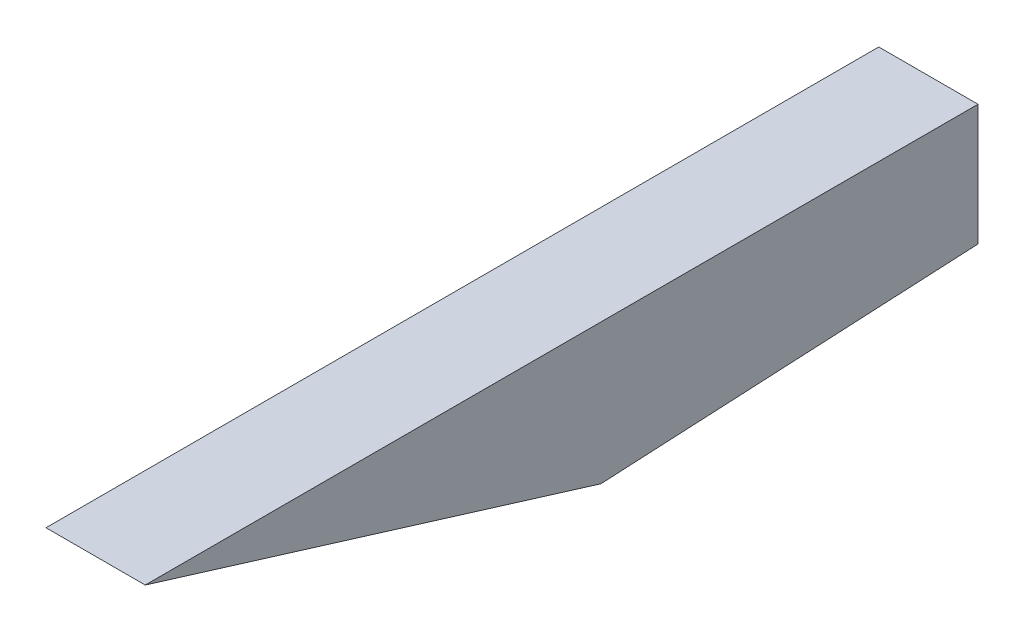
ISO-10303-21;
HEADER;
FILE_DESCRIPTION(('STEP AP214'),'2;1');
FILE_NAME('part.step','',(''),(''),'','','');
FILE_SCHEMA(('AUTOMOTIVE_DESIGN { 1 0 10303 214 1 1 1 1 }'));
ENDSEC;
DATA;
#1=APPLICATION_CONTEXT('core data for automotive mechanical design processes');
#2=APPLICATION_PROTOCOL_DEFINITION('international standard','automotive_design',2000,#1);
#3=PRODUCT_CONTEXT('',#1,'mechanical');
#4=PRODUCT('Part','Part','',(#3));
#5=PRODUCT_RELATED_PRODUCT_CATEGORY('part','',(#4));
#6=PRODUCT_DEFINITION_FORMATION('','',#4);
#7=PRODUCT_DEFINITION_CONTEXT('part definition',#1,'design');
#8=PRODUCT_DEFINITION('design','',#6,#7);
#9=PRODUCT_DEFINITION_SHAPE('','',#8);
#10=(LENGTH_UNIT() NAMED_UNIT(*) SI_UNIT(.MILLI.,.METRE.));
#11=(NAMED_UNIT(*) PLANE_ANGLE_UNIT() SI_UNIT($,.RADIAN.));
#12=(NAMED_UNIT(*) SI_UNIT($,.STERADIAN.) SOLID_ANGLE_UNIT());
#13=UNCERTAINTY_MEASURE_WITH_UNIT(LENGTH_MEASURE(1.E-05),#10,'distance_accuracy_value','');
#14=(GEOMETRIC_REPRESENTATION_CONTEXT(3) GLOBAL_UNCERTAINTY_ASSIGNED_CONTEXT((#13)) GLOBAL_UNIT_ASSIGNED_CONTEXT((#10,
#11,#12)) REPRESENTATION_CONTEXT('',''));
#15=CARTESIAN_POINT('',(0.,0.,0.));
#16=DIRECTION('',(0.,0.,1.));
#17=DIRECTION('',(1.,0.,0.));
#18=AXIS2_PLACEMENT_3D('',#15,#16,#17);
#19=CARTESIAN_POINT('',(0.,0.,-584.2));
#20=DIRECTION('',(0.,0.,1.));
#21=DIRECTION('',(1.,0.,0.));
#22=AXIS2_PLACEMENT_3D('',#19,#20,#21);
#23=PLANE('',#22);
#24=DIRECTION('',(0.,-1.,0.));
#25=VECTOR('',#24,1.);
#26=CARTESIAN_POINT('',(18.161,0.,-584.2));
#27=LINE('',#26,#25);
#28=CARTESIAN_POINT('',(18.161,5.96900000000002,-584.2));
#29=VERTEX_POINT('',#28);
#30=CARTESIAN_POINT('',(18.161,-38.3259162166958,-584.2));
#31=VERTEX_POINT('',#30);
#32=EDGE_CURVE('E11',#29,#31,#27,.T.);
#33=ORIENTED_EDGE('',*,*,#32,.T.);
#34=DIRECTION('',(1.,0.,0.));
#35=VECTOR('',#34,1.);
#36=CARTESIAN_POINT('',(0.,-38.3259162166958,-584.2));
#37=LINE('',#36,#35);
#38=CARTESIAN_POINT('',(-18.161,-38.3259162166958,-584.2));
#39=VERTEX_POINT('',#38);
#40=EDGE_CURVE('E59',#39,#31,#37,.T.);
#41=ORIENTED_EDGE('',*,*,#40,.F.);
#42=DIRECTION('',(0.,-1.,0.));
#43=VECTOR('',#42,1.);
#44=CARTESIAN_POINT('',(-18.161,0.,-584.2));
#45=LINE('',#44,#43);
#46=CARTESIAN_POINT('',(-18.161,5.96900000000002,-584.2));
#47=VERTEX_POINT('',#46);
#48=EDGE_CURVE('E105',#47,#39,#45,.T.);
#49=ORIENTED_EDGE('',*,*,#48,.F.);
#50=DIRECTION('',(1.,0.,0.));
#51=VECTOR('',#50,1.);
#52=CARTESIAN_POINT('',(0.,5.96900000000002,-584.2));
#53=LINE('',#52,#51);
#54=EDGE_CURVE('E52',#47,#29,#53,.T.);
#55=ORIENTED_EDGE('',*,*,#54,.T.);
#56=EDGE_LOOP('',(#33,#41,#49,#55));
#57=FACE_BOUND('',#56,.T.);
#58=ADVANCED_FACE('F45',(#57),#23,.F.);
#59=CARTESIAN_POINT('',(-18.171,5.96900771473894,-279.4));
#60=DIRECTION('',(0.,0.955805662169999,-0.293999211161814));
#61=DIRECTION('',(0.,0.293999211161814,0.955805662169999));
#62=AXIS2_PLACEMENT_3D('',#59,#60,#61);
#63=PLANE('',#62);
#64=CARTESIAN_POINT('',(-18.161,5.96900000000002,-279.40002508099));
#65=DIRECTION('',(1.,0.,0.));
#66=VECTOR('',#65,1.);
#67=LINE('',#64,#66);
#68=CARTESIAN_POINT('',(-18.161,5.96900000000001,-279.400012540495));
#69=VERTEX_POINT('',#68);
#70=CARTESIAN_POINT('',(18.161,5.96900000000002,-279.400012540495));
#71=VERTEX_POINT('',#70);
#72=EDGE_CURVE('E93',#69,#71,#67,.T.);
#73=ORIENTED_EDGE('',*,*,#72,.F.);
#74=DIRECTION('',(0.,0.293999211161814,0.955805662169999));
#75=VECTOR('',#74,1.);
#76=CARTESIAN_POINT('',(-18.161,83.9661806626817,-25.827416446826));
#77=LINE('',#76,#75);
#78=CARTESIAN_POINT('',(-18.161,-45.324750584507,-446.158490346475));
#79=VERTEX_POINT('',#78);
#80=EDGE_CURVE('E97',#79,#69,#77,.T.);
#81=ORIENTED_EDGE('',*,*,#80,.F.);
#82=DIRECTION('',(1.,0.,0.));
#83=VECTOR('',#82,1.);
#84=CARTESIAN_POINT('',(-18.171,-45.324750584507,-446.158490346475));
#85=LINE('',#84,#83);
#86=CARTESIAN_POINT('',(18.161,-45.324750584507,-446.158490346475));
#87=VERTEX_POINT('',#86);
#88=EDGE_CURVE('E83',#79,#87,#85,.T.);
#89=ORIENTED_EDGE('',*,*,#88,.T.);
#90=DIRECTION('',(0.,0.293999211161814,0.955805662169999));
#91=VECTOR('',#90,1.);
#92=CARTESIAN_POINT('',(18.161,83.9661806626817,-25.827416446826));
#93=LINE('',#92,#91);
#94=EDGE_CURVE('E92',#87,#71,#93,.T.);
#95=ORIENTED_EDGE('',*,*,#94,.T.);
#96=EDGE_LOOP('',(#73,#81,#89,#95));
#97=FACE_BOUND('',#96,.T.);
#98=ADVANCED_FACE('F98',(#97),#63,.F.);
#99=CARTESIAN_POINT('',(0.,-67.7711940185204,-3.43606327571275));
#100=DIRECTION('',(0.,0.998717179985735,0.0506359003212277));
#101=DIRECTION('',(0.,-0.0506359003212277,0.998717179985735));
#102=AXIS2_PLACEMENT_3D('',#99,#100,#101);
#103=PLANE('',#102);
#104=DIRECTION('',(0.,0.0506359003212277,-0.998717179985735));
#105=VECTOR('',#104,1.);
#106=CARTESIAN_POINT('',(-18.161,-67.7711940185204,-3.43606327571275));
#107=LINE('',#106,#105);
#108=EDGE_CURVE('E87',#79,#39,#107,.T.);
#109=ORIENTED_EDGE('',*,*,#108,.T.);
#110=ORIENTED_EDGE('',*,*,#40,.T.);
#111=DIRECTION('',(0.,0.0506359003212277,-0.998717179985735));
#112=VECTOR('',#111,1.);
#113=CARTESIAN_POINT('',(18.161,-67.7711940185204,-3.43606327571275));
#114=LINE('',#113,#112);
#115=EDGE_CURVE('E89',#87,#31,#114,.T.);
#116=ORIENTED_EDGE('',*,*,#115,.F.);
#117=ORIENTED_EDGE('',*,*,#88,.F.);
#118=EDGE_LOOP('',(#109,#110,#116,#117));
#119=FACE_BOUND('',#118,.T.);
#120=ADVANCED_FACE('F85',(#119),#103,.F.);
#121=CARTESIAN_POINT('',(0.,5.96900000000002,0.));
#122=DIRECTION('',(0.,1.,0.));
#123=DIRECTION('',(0.,0.,1.));
#124=AXIS2_PLACEMENT_3D('',#121,#122,#123);
#125=PLANE('',#124);
#126=ORIENTED_EDGE('',*,*,#54,.F.);
#127=DIRECTION('',(0.,0.,1.));
#128=VECTOR('',#127,1.);
#129=CARTESIAN_POINT('',(-18.161,5.96900000000002,0.));
#130=LINE('',#129,#128);
#131=EDGE_CURVE('E117',#47,#69,#130,.T.);
#132=ORIENTED_EDGE('',*,*,#131,.T.);
#133=ORIENTED_EDGE('',*,*,#72,.T.);
#134=DIRECTION('',(0.,0.,1.));
#135=VECTOR('',#134,1.);
#136=CARTESIAN_POINT('',(18.161,5.96900000000002,0.));
#137=LINE('',#136,#135);
#138=EDGE_CURVE('E107',#29,#71,#137,.T.);
#139=ORIENTED_EDGE('',*,*,#138,.F.);
#140=EDGE_LOOP('',(#126,#132,#133,#139));
#141=FACE_BOUND('',#140,.T.);
#142=ADVANCED_FACE('F131',(#141),#125,.T.);
#143=CARTESIAN_POINT('',(-18.161,0.,0.));
#144=DIRECTION('',(1.,0.,0.));
#145=DIRECTION('',(0.,0.,-1.));
#146=AXIS2_PLACEMENT_3D('',#143,#144,#145);
#147=PLANE('',#146);
#148=ORIENTED_EDGE('',*,*,#131,.F.);
#149=ORIENTED_EDGE('',*,*,#48,.T.);
#150=ORIENTED_EDGE('',*,*,#108,.F.);
#151=ORIENTED_EDGE('',*,*,#80,.T.);
#152=EDGE_LOOP('',(#148,#149,#150,#151));
#153=FACE_BOUND('',#152,.T.);
#154=ADVANCED_FACE('F104',(#153),#147,.F.);
#155=CARTESIAN_POINT('',(18.161,0.,0.));
#156=DIRECTION('',(1.,0.,0.));
#157=DIRECTION('',(0.,0.,-1.));
#158=AXIS2_PLACEMENT_3D('',#155,#156,#157);
#159=PLANE('',#158);
#160=ORIENTED_EDGE('',*,*,#32,.F.);
#161=ORIENTED_EDGE('',*,*,#138,.T.);
#162=ORIENTED_EDGE('',*,*,#94,.F.);
#163=ORIENTED_EDGE('',*,*,#115,.T.);
#164=EDGE_LOOP('',(#160,#161,#162,#163));
#165=FACE_BOUND('',#164,.T.);
#166=ADVANCED_FACE('F144',(#165),#159,.T.);
#167=CLOSED_SHELL('',(#58,#98,#120,#142,#154,#166));
#168=MANIFOLD_SOLID_BREP('B2',#167);
#169=ADVANCED_BREP_SHAPE_REPRESENTATION('',(#18,#168),#14);
#170=SHAPE_DEFINITION_REPRESENTATION(#9,#169);
ENDSEC;
END-ISO-10303-21;
